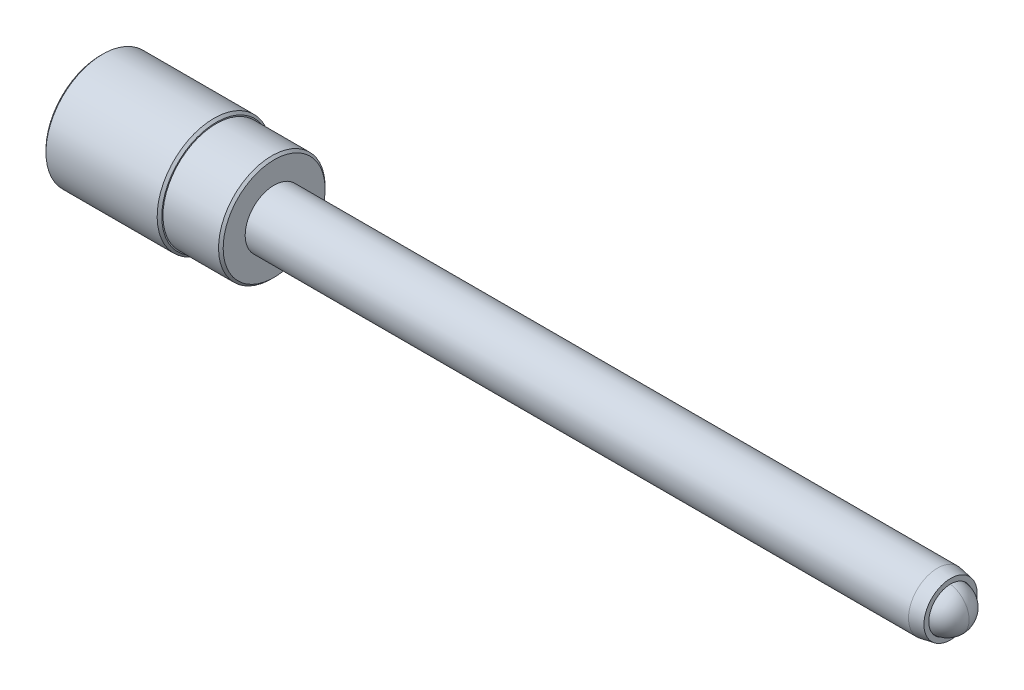
ISO-10303-21;
HEADER;
FILE_DESCRIPTION(('STEP AP214'),'2;1');
FILE_NAME('part.step','',(''),(''),'','','');
FILE_SCHEMA(('AUTOMOTIVE_DESIGN { 1 0 10303 214 1 1 1 1 }'));
ENDSEC;
DATA;
#1=APPLICATION_CONTEXT('core data for automotive mechanical design processes');
#2=APPLICATION_PROTOCOL_DEFINITION('international standard','automotive_design',2000,#1);
#3=PRODUCT_CONTEXT('',#1,'mechanical');
#4=PRODUCT('Part','Part','',(#3));
#5=PRODUCT_RELATED_PRODUCT_CATEGORY('part','',(#4));
#6=PRODUCT_DEFINITION_FORMATION('','',#4);
#7=PRODUCT_DEFINITION_CONTEXT('part definition',#1,'design');
#8=PRODUCT_DEFINITION('design','',#6,#7);
#9=PRODUCT_DEFINITION_SHAPE('','',#8);
#10=(LENGTH_UNIT() NAMED_UNIT(*) SI_UNIT(.MILLI.,.METRE.));
#11=(NAMED_UNIT(*) PLANE_ANGLE_UNIT() SI_UNIT($,.RADIAN.));
#12=(NAMED_UNIT(*) SI_UNIT($,.STERADIAN.) SOLID_ANGLE_UNIT());
#13=UNCERTAINTY_MEASURE_WITH_UNIT(LENGTH_MEASURE(1.E-05),#10,'distance_accuracy_value','');
#14=(GEOMETRIC_REPRESENTATION_CONTEXT(3) GLOBAL_UNCERTAINTY_ASSIGNED_CONTEXT((#13)) GLOBAL_UNIT_ASSIGNED_CONTEXT((#10,
#11,#12)) REPRESENTATION_CONTEXT('',''));
#15=CARTESIAN_POINT('',(0.,0.,0.));
#16=DIRECTION('',(0.,0.,1.));
#17=DIRECTION('',(1.,0.,0.));
#18=AXIS2_PLACEMENT_3D('',#15,#16,#17);
#19=CARTESIAN_POINT('',(-46.646795063286,1.45707902118473,-6.1692099702189));
#20=DIRECTION('',(-0.00174282414838957,-2.55916137059528E-06,0.999998481277566));
#21=DIRECTION('',(-0.00293678959253368,0.999995687620872,-2.55916137277076E-06));
#22=AXIS2_PLACEMENT_3D('',#19,#20,#21);
#23=SPHERICAL_SURFACE('',#22,1.190625);
#24=CARTESIAN_POINT('',(-46.6488701132877,1.45707597418323,-4.9785867784478));
#25=VERTEX_POINT('',#24);
#26=VERTEX_LOOP('',#25);
#27=FACE_BOUND('',#26,.T.);
#28=ADVANCED_FACE('P0_F13',(#27),#23,.T.);
#29=CLOSED_SHELL('',(#28));
#30=MANIFOLD_SOLID_BREP('P0_B1',#29);
#31=CARTESIAN_POINT('',(-47.837420063286,1.58320286749358,-2.10278836630096));
#32=DIRECTION('',(-1.,0.,0.));
#33=DIRECTION('',(0.,0.0426559823998968,0.999089819368359));
#34=AXIS2_PLACEMENT_3D('',#31,#32,#33);
#35=PLANE('',#34);
#36=CARTESIAN_POINT('',(-47.837420063286,1.58320286749358,-2.10278836630096));
#37=DIRECTION('',(-1.,0.,0.));
#38=DIRECTION('',(0.,0.0426559823998968,0.999089819368359));
#39=AXIS2_PLACEMENT_3D('',#36,#37,#38);
#40=CIRCLE('',#39,5.96899999999999);
#41=CARTESIAN_POINT('',(-47.837420063286,1.83781642643856,3.86077876550877));
#42=VERTEX_POINT('',#41);
#43=EDGE_CURVE('P1_E30',#42,#42,#40,.T.);
#44=ORIENTED_EDGE('',*,*,#43,.T.);
#45=EDGE_LOOP('',(#44));
#46=FACE_BOUND('',#45,.T.);
#47=CARTESIAN_POINT('',(-47.837420063286,1.4098489550204,-6.16308939221397));
#48=DIRECTION('',(-1.,0.,0.));
#49=DIRECTION('',(0.,0.0426559823998968,0.999089819368359));
#50=AXIS2_PLACEMENT_3D('',#47,#48,#49);
#51=CIRCLE('',#50,1.143);
#52=CARTESIAN_POINT('',(-47.837420063286,1.45860474290348,-5.02112972867593));
#53=VERTEX_POINT('',#52);
#54=EDGE_CURVE('P1_E57',#53,#53,#51,.T.);
#55=ORIENTED_EDGE('',*,*,#54,.F.);
#56=EDGE_LOOP('',(#55));
#57=FACE_BOUND('',#56,.T.);
#58=ADVANCED_FACE('P1_F15',(#46,#57),#35,.T.);
#59=CARTESIAN_POINT('',(-28.787420063286,1.58320286749358,-2.10278836630096));
#60=DIRECTION('',(1.,0.,0.));
#61=DIRECTION('',(0.,-0.0426559823998968,-0.999089819368359));
#62=AXIS2_PLACEMENT_3D('',#59,#60,#61);
#63=CYLINDRICAL_SURFACE('',#62,6.223);
#64=CARTESIAN_POINT('',(-47.583420063286,1.58320286749358,-2.10278836630096));
#65=DIRECTION('',(-1.,0.,0.));
#66=DIRECTION('',(0.,0.0426559823998968,0.999089819368359));
#67=AXIS2_PLACEMENT_3D('',#64,#65,#66);
#68=CIRCLE('',#67,6.223);
#69=CARTESIAN_POINT('',(-47.583420063286,1.84865104596814,4.11454757962834));
#70=VERTEX_POINT('',#69);
#71=EDGE_CURVE('P1_E35',#70,#70,#68,.F.);
#72=ORIENTED_EDGE('',*,*,#71,.T.);
#73=EDGE_LOOP('',(#72));
#74=FACE_BOUND('',#73,.T.);
#75=CARTESIAN_POINT('',(-35.391420063286,1.58320286749358,-2.10278836630096));
#76=DIRECTION('',(1.,0.,0.));
#77=DIRECTION('',(0.,-0.0426559823998968,-0.999089819368359));
#78=AXIS2_PLACEMENT_3D('',#75,#76,#77);
#79=CIRCLE('',#78,6.223);
#80=CARTESIAN_POINT('',(-35.391420063286,1.31775468901902,-8.32012431223025));
#81=VERTEX_POINT('',#80);
#82=EDGE_CURVE('P1_E38',#81,#81,#79,.F.);
#83=ORIENTED_EDGE('',*,*,#82,.T.);
#84=EDGE_LOOP('',(#83));
#85=FACE_BOUND('',#84,.T.);
#86=ADVANCED_FACE('P1_F73',(#74,#85),#63,.T.);
#87=CARTESIAN_POINT('',(-35.137420063286,1.31775468901902,-8.32012431223025));
#88=DIRECTION('',(1.,0.,0.));
#89=DIRECTION('',(0.,-0.0426559823998968,-0.999089819368359));
#90=AXIS2_PLACEMENT_3D('',#87,#88,#89);
#91=PLANE('',#90);
#92=CARTESIAN_POINT('',(-35.137420063286,1.58320286749358,-2.10278836630096));
#93=DIRECTION('',(1.,0.,0.));
#94=DIRECTION('',(0.,-0.0426559823998968,-0.999089819368359));
#95=AXIS2_PLACEMENT_3D('',#92,#93,#94);
#96=CIRCLE('',#95,5.969);
#97=CARTESIAN_POINT('',(-35.137420063286,1.32858930854859,-8.06635549811069));
#98=VERTEX_POINT('',#97);
#99=EDGE_CURVE('P1_E10',#98,#98,#96,.T.);
#100=ORIENTED_EDGE('',*,*,#99,.T.);
#101=EDGE_LOOP('',(#100));
#102=FACE_BOUND('',#101,.T.);
#103=CARTESIAN_POINT('',(-35.137420063286,1.58320286749358,-2.10278836630096));
#104=DIRECTION('',(1.,0.,0.));
#105=DIRECTION('',(0.,-0.0426559823998968,-0.999089819368359));
#106=AXIS2_PLACEMENT_3D('',#103,#104,#105);
#107=CIRCLE('',#106,5.842);
#108=CARTESIAN_POINT('',(-35.137420063286,1.33400661831338,-7.93947109105091));
#109=VERTEX_POINT('',#108);
#110=EDGE_CURVE('P1_E41',#109,#109,#107,.T.);
#111=ORIENTED_EDGE('',*,*,#110,.F.);
#112=EDGE_LOOP('',(#111));
#113=FACE_BOUND('',#112,.T.);
#114=ADVANCED_FACE('P1_F80',(#102,#113),#91,.T.);
#115=CARTESIAN_POINT('',(-28.787420063286,1.58320286749358,-2.10278836630096));
#116=DIRECTION('',(1.,0.,0.));
#117=DIRECTION('',(0.,-0.0426559823998968,-0.999089819368359));
#118=AXIS2_PLACEMENT_3D('',#115,#116,#117);
#119=CYLINDRICAL_SURFACE('',#118,5.842);
#120=CARTESIAN_POINT('',(-29.041420063286,1.58320286749358,-2.10278836630096));
#121=DIRECTION('',(1.,0.,0.));
#122=DIRECTION('',(0.,-0.0426559823998968,-0.999089819368359));
#123=AXIS2_PLACEMENT_3D('',#120,#121,#122);
#124=CIRCLE('',#123,5.842);
#125=CARTESIAN_POINT('',(-29.041420063286,1.33400661831338,-7.93947109105091));
#126=VERTEX_POINT('',#125);
#127=EDGE_CURVE('P1_E22',#126,#126,#124,.F.);
#128=ORIENTED_EDGE('',*,*,#127,.T.);
#129=EDGE_LOOP('',(#128));
#130=FACE_BOUND('',#129,.T.);
#131=ORIENTED_EDGE('',*,*,#110,.T.);
#132=EDGE_LOOP('',(#131));
#133=FACE_BOUND('',#132,.T.);
#134=ADVANCED_FACE('P1_F102',(#130,#133),#119,.T.);
#135=CARTESIAN_POINT('',(-28.787420063286,1.33400661831338,-7.93947109105091));
#136=DIRECTION('',(1.,0.,0.));
#137=DIRECTION('',(0.,-0.0426559823998968,-0.999089819368359));
#138=AXIS2_PLACEMENT_3D('',#135,#136,#137);
#139=PLANE('',#138);
#140=CARTESIAN_POINT('',(-28.787420063286,1.58320286749358,-2.10278836630096));
#141=DIRECTION('',(1.,0.,0.));
#142=DIRECTION('',(0.,-0.0426559823998968,-0.999089819368359));
#143=AXIS2_PLACEMENT_3D('',#140,#141,#142);
#144=CIRCLE('',#143,5.588);
#145=CARTESIAN_POINT('',(-28.787420063286,1.34484123784295,-7.68570227693135));
#146=VERTEX_POINT('',#145);
#147=EDGE_CURVE('P1_E26',#146,#146,#144,.T.);
#148=ORIENTED_EDGE('',*,*,#147,.T.);
#149=EDGE_LOOP('',(#148));
#150=FACE_BOUND('',#149,.T.);
#151=CARTESIAN_POINT('',(-28.787420063286,1.58320286749358,-2.10278836630096));
#152=DIRECTION('',(1.,0.,0.));
#153=DIRECTION('',(0.,-0.0426559823998968,-0.999089819368359));
#154=AXIS2_PLACEMENT_3D('',#151,#152,#153);
#155=CIRCLE('',#154,3.1496);
#156=CARTESIAN_POINT('',(-28.787420063286,1.44885358532686,-5.24952166138354));
#157=VERTEX_POINT('',#156);
#158=EDGE_CURVE('P1_E51',#157,#157,#155,.T.);
#159=ORIENTED_EDGE('',*,*,#158,.F.);
#160=EDGE_LOOP('',(#159));
#161=FACE_BOUND('',#160,.T.);
#162=ADVANCED_FACE('P1_F98',(#150,#161),#139,.T.);
#163=CARTESIAN_POINT('',(-34.883420063286,1.58320286749358,-2.10278836630096));
#164=DIRECTION('',(1.,0.,0.));
#165=DIRECTION('',(0.,-0.0426559823998968,-0.999089819368359));
#166=AXIS2_PLACEMENT_3D('',#163,#164,#165);
#167=PLANE('',#166);
#168=CARTESIAN_POINT('',(-34.883420063286,1.58320286749358,-2.10278836630096));
#169=DIRECTION('',(1.,0.,0.));
#170=DIRECTION('',(0.,-0.0426559823998968,-0.999089819368359));
#171=AXIS2_PLACEMENT_3D('',#168,#169,#170);
#172=CIRCLE('',#171,3.1496);
#173=CARTESIAN_POINT('',(-34.883420063286,1.44885358532686,-5.24952166138354));
#174=VERTEX_POINT('',#173);
#175=EDGE_CURVE('P1_E46',#174,#174,#172,.T.);
#176=ORIENTED_EDGE('',*,*,#175,.T.);
#177=EDGE_LOOP('',(#176));
#178=FACE_BOUND('',#177,.T.);
#179=CARTESIAN_POINT('',(-34.883420063286,1.58320286749358,-2.10278836630096));
#180=DIRECTION('',(1.,0.,0.));
#181=DIRECTION('',(0.,-0.0426559823998968,-0.999089819368359));
#182=AXIS2_PLACEMENT_3D('',#179,#180,#181);
#183=CIRCLE('',#182,2.9718);
#184=CARTESIAN_POINT('',(-34.883420063286,1.45643781899756,-5.07188349149984));
#185=VERTEX_POINT('',#184);
#186=EDGE_CURVE('P1_E42',#185,#185,#183,.F.);
#187=ORIENTED_EDGE('',*,*,#186,.T.);
#188=EDGE_LOOP('',(#187));
#189=FACE_BOUND('',#188,.T.);
#190=ADVANCED_FACE('P1_F101',(#178,#189),#167,.T.);
#191=CARTESIAN_POINT('',(-34.883420063286,1.58320286749358,-2.10278836630096));
#192=DIRECTION('',(1.,0.,0.));
#193=DIRECTION('',(0.,-0.0426559823998968,-0.999089819368359));
#194=AXIS2_PLACEMENT_3D('',#191,#192,#193);
#195=CYLINDRICAL_SURFACE('',#194,3.1496);
#196=ORIENTED_EDGE('',*,*,#175,.F.);
#197=EDGE_LOOP('',(#196));
#198=FACE_BOUND('',#197,.T.);
#199=ORIENTED_EDGE('',*,*,#158,.T.);
#200=EDGE_LOOP('',(#199));
#201=FACE_BOUND('',#200,.T.);
#202=ADVANCED_FACE('P1_F106',(#198,#201),#195,.F.);
#203=CARTESIAN_POINT('',(-41.487420063286,1.58320286749358,-2.10278836630096));
#204=DIRECTION('',(1.,0.,0.));
#205=DIRECTION('',(0.,-0.0426559823998968,-0.999089819368359));
#206=AXIS2_PLACEMENT_3D('',#203,#204,#205);
#207=PLANE('',#206);
#208=CARTESIAN_POINT('',(-41.487420063286,1.58320286749358,-2.10278836630096));
#209=DIRECTION('',(1.,0.,0.));
#210=DIRECTION('',(0.,-0.0426559823998968,-0.999089819368359));
#211=AXIS2_PLACEMENT_3D('',#208,#209,#210);
#212=CIRCLE('',#211,2.9718);
#213=CARTESIAN_POINT('',(-41.487420063286,1.45643781899756,-5.07188349149984));
#214=VERTEX_POINT('',#213);
#215=EDGE_CURVE('P1_E45',#214,#214,#212,.T.);
#216=ORIENTED_EDGE('',*,*,#215,.T.);
#217=EDGE_LOOP('',(#216));
#218=FACE_BOUND('',#217,.T.);
#219=ADVANCED_FACE('P1_F108',(#218),#207,.T.);
#220=CARTESIAN_POINT('',(-41.487420063286,1.58320286749358,-2.10278836630096));
#221=DIRECTION('',(1.,0.,0.));
#222=DIRECTION('',(0.,-0.0426559823998968,-0.999089819368359));
#223=AXIS2_PLACEMENT_3D('',#220,#221,#222);
#224=CYLINDRICAL_SURFACE('',#223,2.9718);
#225=ORIENTED_EDGE('',*,*,#215,.F.);
#226=EDGE_LOOP('',(#225));
#227=FACE_BOUND('',#226,.T.);
#228=ORIENTED_EDGE('',*,*,#186,.F.);
#229=EDGE_LOOP('',(#228));
#230=FACE_BOUND('',#229,.T.);
#231=ADVANCED_FACE('P1_F68',(#227,#230),#224,.F.);
#232=CARTESIAN_POINT('',(-45.551420063286,1.4098489550204,-6.16308939221397));
#233=DIRECTION('',(-1.,0.,0.));
#234=DIRECTION('',(0.,0.0426559823998968,0.999089819368359));
#235=AXIS2_PLACEMENT_3D('',#232,#233,#234);
#236=CYLINDRICAL_SURFACE('',#235,1.143);
#237=CARTESIAN_POINT('',(-45.551420063286,1.4098489550204,-6.16308939221397));
#238=DIRECTION('',(-1.,0.,0.));
#239=DIRECTION('',(0.,0.0426559823998968,0.999089819368359));
#240=AXIS2_PLACEMENT_3D('',#237,#238,#239);
#241=CIRCLE('',#240,1.143);
#242=CARTESIAN_POINT('',(-45.551420063286,1.45860474290348,-5.02112972867593));
#243=VERTEX_POINT('',#242);
#244=EDGE_CURVE('P1_E54',#243,#243,#241,.T.);
#245=ORIENTED_EDGE('',*,*,#244,.F.);
#246=EDGE_LOOP('',(#245));
#247=FACE_BOUND('',#246,.T.);
#248=ORIENTED_EDGE('',*,*,#54,.T.);
#249=EDGE_LOOP('',(#248));
#250=FACE_BOUND('',#249,.T.);
#251=ADVANCED_FACE('P1_F65',(#247,#250),#236,.F.);
#252=CARTESIAN_POINT('',(-45.551420063286,1.4098489550204,-6.16308939221397));
#253=DIRECTION('',(-1.,0.,0.));
#254=DIRECTION('',(0.,0.0426559823998968,0.999089819368359));
#255=AXIS2_PLACEMENT_3D('',#252,#253,#254);
#256=PLANE('',#255);
#257=ORIENTED_EDGE('',*,*,#244,.T.);
#258=EDGE_LOOP('',(#257));
#259=FACE_BOUND('',#258,.T.);
#260=ADVANCED_FACE('P1_F63',(#259),#256,.T.);
#261=CARTESIAN_POINT('',(-47.583420063286,1.58320286749358,-2.10278836630096));
#262=DIRECTION('',(1.,0.,0.));
#263=DIRECTION('',(0.,-0.0426559823998968,-0.999089819368359));
#264=AXIS2_PLACEMENT_3D('',#261,#262,#263);
#265=CONICAL_SURFACE('',#264,6.223,0.78539816339745);
#266=ORIENTED_EDGE('',*,*,#43,.F.);
#267=EDGE_LOOP('',(#266));
#268=FACE_BOUND('',#267,.T.);
#269=ORIENTED_EDGE('',*,*,#71,.F.);
#270=EDGE_LOOP('',(#269));
#271=FACE_BOUND('',#270,.T.);
#272=ADVANCED_FACE('P1_F85',(#268,#271),#265,.T.);
#273=CARTESIAN_POINT('',(-28.787420063286,1.58320286749358,-2.10278836630096));
#274=DIRECTION('',(-1.,0.,0.));
#275=DIRECTION('',(0.,0.0426559823998968,0.999089819368359));
#276=AXIS2_PLACEMENT_3D('',#273,#274,#275);
#277=CONICAL_SURFACE('',#276,5.588,0.785398163397443);
#278=ORIENTED_EDGE('',*,*,#127,.F.);
#279=EDGE_LOOP('',(#278));
#280=FACE_BOUND('',#279,.T.);
#281=ORIENTED_EDGE('',*,*,#147,.F.);
#282=EDGE_LOOP('',(#281));
#283=FACE_BOUND('',#282,.T.);
#284=ADVANCED_FACE('P1_F87',(#280,#283),#277,.T.);
#285=CARTESIAN_POINT('',(-35.137420063286,1.58320286749358,-2.10278836630096));
#286=DIRECTION('',(-1.,0.,0.));
#287=DIRECTION('',(0.,0.0426559823998968,0.999089819368359));
#288=AXIS2_PLACEMENT_3D('',#285,#286,#287);
#289=CONICAL_SURFACE('',#288,5.969,0.785398163397447);
#290=ORIENTED_EDGE('',*,*,#82,.F.);
#291=EDGE_LOOP('',(#290));
#292=FACE_BOUND('',#291,.T.);
#293=ORIENTED_EDGE('',*,*,#99,.F.);
#294=EDGE_LOOP('',(#293));
#295=FACE_BOUND('',#294,.T.);
#296=ADVANCED_FACE('P1_F17',(#292,#295),#289,.T.);
#297=CLOSED_SHELL('',(#58,#86,#114,#134,#162,#190,#202,#219,#231,#251,#260,#272,#284,#296));
#298=MANIFOLD_SOLID_BREP('P1_B1',#297);
#299=CARTESIAN_POINT('',(45.031329936714,1.58320286749359,-2.10278836630096));
#300=DIRECTION('',(-1.,0.,0.));
#301=DIRECTION('',(0.,1.,0.));
#302=AXIS2_PLACEMENT_3D('',#299,#300,#301);
#303=SPHERICAL_SURFACE('',#302,2.38125);
#304=CARTESIAN_POINT('',(45.031329936714,1.58320286749359,-2.10278836630096));
#305=DIRECTION('',(0.,0.,1.));
#306=DIRECTION('',(0.,1.,0.));
#307=AXIS2_PLACEMENT_3D('',#304,#305,#306);
#308=CIRCLE('',#307,2.38125);
#309=CARTESIAN_POINT('',(45.031329936714,3.96445286749359,-2.10278836630096));
#310=VERTEX_POINT('',#309);
#311=CARTESIAN_POINT('',(45.031329936714,-0.798047132506413,-2.10278836630096));
#312=VERTEX_POINT('',#311);
#313=EDGE_CURVE('P2_E33',#310,#312,#308,.T.);
#314=ORIENTED_EDGE('',*,*,#313,.T.);
#315=CARTESIAN_POINT('',(45.031329936714,1.58320286749359,-2.10278836630096));
#316=DIRECTION('',(-1.,0.,0.));
#317=DIRECTION('',(0.,0.,1.));
#318=AXIS2_PLACEMENT_3D('',#315,#316,#317);
#319=CIRCLE('',#318,2.38125);
#320=EDGE_CURVE('P2_E10',#312,#310,#319,.T.);
#321=ORIENTED_EDGE('',*,*,#320,.T.);
#322=EDGE_LOOP('',(#314,#321));
#323=FACE_BOUND('',#322,.T.);
#324=ADVANCED_FACE('P2_F16',(#323),#303,.T.);
#325=ORIENTED_EDGE('',*,*,#313,.F.);
#326=CARTESIAN_POINT('',(45.031329936714,1.58320286749359,-2.10278836630096));
#327=DIRECTION('',(-1.,0.,0.));
#328=DIRECTION('',(0.,0.,1.));
#329=AXIS2_PLACEMENT_3D('',#326,#327,#328);
#330=CIRCLE('',#329,2.38125);
#331=EDGE_CURVE('P2_E23',#310,#312,#330,.T.);
#332=ORIENTED_EDGE('',*,*,#331,.T.);
#333=EDGE_LOOP('',(#325,#332));
#334=FACE_BOUND('',#333,.T.);
#335=ADVANCED_FACE('P2_F40',(#334),#303,.T.);
#336=ORIENTED_EDGE('',*,*,#320,.F.);
#337=EDGE_CURVE('P2_E36',#312,#310,#308,.T.);
#338=ORIENTED_EDGE('',*,*,#337,.T.);
#339=EDGE_LOOP('',(#336,#338));
#340=FACE_BOUND('',#339,.T.);
#341=ADVANCED_FACE('P2_F38',(#340),#303,.T.);
#342=ORIENTED_EDGE('',*,*,#331,.F.);
#343=ORIENTED_EDGE('',*,*,#337,.F.);
#344=EDGE_LOOP('',(#342,#343));
#345=FACE_BOUND('',#344,.T.);
#346=ADVANCED_FACE('P2_F18',(#345),#303,.T.);
#347=CLOSED_SHELL('',(#324,#335,#341,#346));
#348=MANIFOLD_SOLID_BREP('P2_B1',#347);
#349=CARTESIAN_POINT('',(41.6637338913131,1.58320286749359,-2.10278836630096));
#350=DIRECTION('',(1.,0.,0.));
#351=DIRECTION('',(0.,1.,0.));
#352=AXIS2_PLACEMENT_3D('',#349,#350,#351);
#353=CONICAL_SURFACE('',#352,0.,0.78539816339745);
#354=CARTESIAN_POINT('',(44.051333891313,1.58320286749359,-2.10278836630096));
#355=DIRECTION('',(1.,0.,0.));
#356=DIRECTION('',(0.,1.,0.));
#357=AXIS2_PLACEMENT_3D('',#354,#355,#356);
#358=CIRCLE('',#357,2.3876);
#359=CARTESIAN_POINT('',(44.051333891313,3.97080286749359,-2.10278836630096));
#360=VERTEX_POINT('',#359);
#361=EDGE_CURVE('P3_E11',#360,#360,#358,.T.);
#362=ORIENTED_EDGE('',*,*,#361,.T.);
#363=EDGE_LOOP('',(#362));
#364=FACE_BOUND('',#363,.T.);
#365=CARTESIAN_POINT('',(41.6637338913131,1.58320286749359,-2.10278836630096));
#366=VERTEX_POINT('',#365);
#367=VERTEX_LOOP('',#366);
#368=FACE_BOUND('',#367,.T.);
#369=ADVANCED_FACE('P3_F17',(#364,#368),#353,.F.);
#370=CARTESIAN_POINT('',(41.6637338913131,1.58320286749359,-2.10278836630096));
#371=DIRECTION('',(1.,0.,0.));
#372=DIRECTION('',(0.,1.,0.));
#373=AXIS2_PLACEMENT_3D('',#370,#371,#372);
#374=CYLINDRICAL_SURFACE('',#373,2.3876);
#375=CARTESIAN_POINT('',(45.380579936714,1.58320286749359,-2.10278836630096));
#376=DIRECTION('',(1.,0.,0.));
#377=DIRECTION('',(0.,1.,0.));
#378=AXIS2_PLACEMENT_3D('',#375,#376,#377);
#379=CIRCLE('',#378,2.3876);
#380=CARTESIAN_POINT('',(45.380579936714,3.97080286749359,-2.10278836630096));
#381=VERTEX_POINT('',#380);
#382=EDGE_CURVE('P3_E23',#381,#381,#379,.T.);
#383=ORIENTED_EDGE('',*,*,#382,.T.);
#384=EDGE_LOOP('',(#383));
#385=FACE_BOUND('',#384,.T.);
#386=ORIENTED_EDGE('',*,*,#361,.F.);
#387=EDGE_LOOP('',(#386));
#388=FACE_BOUND('',#387,.T.);
#389=ADVANCED_FACE('P3_F27',(#385,#388),#374,.F.);
#390=CARTESIAN_POINT('',(45.380579936714,4.50420286749358,-2.10278836630096));
#391=DIRECTION('',(1.,0.,0.));
#392=DIRECTION('',(0.,1.,0.));
#393=AXIS2_PLACEMENT_3D('',#390,#391,#392);
#394=PLANE('',#393);
#395=CARTESIAN_POINT('',(45.380579936714,1.58320286749359,-2.10278836630096));
#396=DIRECTION('',(1.,0.,0.));
#397=DIRECTION('',(0.,1.,0.));
#398=AXIS2_PLACEMENT_3D('',#395,#396,#397);
#399=CIRCLE('',#398,2.92099999999999);
#400=CARTESIAN_POINT('',(45.380579936714,4.50420286749358,-2.10278836630096));
#401=VERTEX_POINT('',#400);
#402=EDGE_CURVE('P3_E72',#401,#401,#399,.T.);
#403=ORIENTED_EDGE('',*,*,#402,.T.);
#404=EDGE_LOOP('',(#403));
#405=FACE_BOUND('',#404,.T.);
#406=ORIENTED_EDGE('',*,*,#382,.F.);
#407=EDGE_LOOP('',(#406));
#408=FACE_BOUND('',#407,.T.);
#409=ADVANCED_FACE('P3_F33',(#405,#408),#394,.T.);
#410=CARTESIAN_POINT('',(45.380579936714,1.58320286749359,-2.10278836630096));
#411=DIRECTION('',(-1.,0.,0.));
#412=DIRECTION('',(0.,-1.,0.));
#413=AXIS2_PLACEMENT_3D('',#410,#411,#412);
#414=CONICAL_SURFACE('',#413,2.92099999999999,0.174532925199434);
#415=CARTESIAN_POINT('',(43.9400743545311,1.58320286749359,-2.10278836630096));
#416=DIRECTION('',(1.,0.,0.));
#417=DIRECTION('',(0.,1.,0.));
#418=AXIS2_PLACEMENT_3D('',#415,#416,#417);
#419=CIRCLE('',#418,3.17499999999999);
#420=CARTESIAN_POINT('',(43.9400743545311,4.75820286749358,-2.10278836630096));
#421=VERTEX_POINT('',#420);
#422=EDGE_CURVE('P3_E67',#421,#421,#419,.T.);
#423=ORIENTED_EDGE('',*,*,#422,.T.);
#424=EDGE_LOOP('',(#423));
#425=FACE_BOUND('',#424,.T.);
#426=ORIENTED_EDGE('',*,*,#402,.F.);
#427=EDGE_LOOP('',(#426));
#428=FACE_BOUND('',#427,.T.);
#429=ADVANCED_FACE('P3_F40',(#425,#428),#414,.T.);
#430=CARTESIAN_POINT('',(41.6637338913131,1.58320286749359,-2.10278836630096));
#431=DIRECTION('',(1.,0.,0.));
#432=DIRECTION('',(0.,1.,0.));
#433=AXIS2_PLACEMENT_3D('',#430,#431,#432);
#434=CYLINDRICAL_SURFACE('',#433,3.175);
#435=CARTESIAN_POINT('',(-41.233420063286,1.58320286749358,-2.10278836630096));
#436=DIRECTION('',(1.,0.,0.));
#437=DIRECTION('',(0.,1.,0.));
#438=AXIS2_PLACEMENT_3D('',#435,#436,#437);
#439=CIRCLE('',#438,3.175);
#440=CARTESIAN_POINT('',(-41.233420063286,4.75820286749358,-2.10278836630096));
#441=VERTEX_POINT('',#440);
#442=EDGE_CURVE('P3_E64',#441,#441,#439,.T.);
#443=ORIENTED_EDGE('',*,*,#442,.T.);
#444=EDGE_LOOP('',(#443));
#445=FACE_BOUND('',#444,.T.);
#446=ORIENTED_EDGE('',*,*,#422,.F.);
#447=EDGE_LOOP('',(#446));
#448=FACE_BOUND('',#447,.T.);
#449=ADVANCED_FACE('P3_F47',(#445,#448),#434,.T.);
#450=CARTESIAN_POINT('',(-41.233420063286,1.58320286749358,-2.10278836630096));
#451=DIRECTION('',(1.,0.,0.));
#452=DIRECTION('',(0.,1.,0.));
#453=AXIS2_PLACEMENT_3D('',#450,#451,#452);
#454=CONICAL_SURFACE('',#453,3.175,0.78539816339744);
#455=CARTESIAN_POINT('',(-41.487420063286,1.58320286749358,-2.10278836630096));
#456=DIRECTION('',(1.,0.,0.));
#457=DIRECTION('',(0.,1.,0.));
#458=AXIS2_PLACEMENT_3D('',#455,#456,#457);
#459=CIRCLE('',#458,2.921);
#460=CARTESIAN_POINT('',(-41.487420063286,4.50420286749358,-2.10278836630096));
#461=VERTEX_POINT('',#460);
#462=EDGE_CURVE('P3_E63',#461,#461,#459,.T.);
#463=ORIENTED_EDGE('',*,*,#462,.T.);
#464=EDGE_LOOP('',(#463));
#465=FACE_BOUND('',#464,.T.);
#466=ORIENTED_EDGE('',*,*,#442,.F.);
#467=EDGE_LOOP('',(#466));
#468=FACE_BOUND('',#467,.T.);
#469=ADVANCED_FACE('P3_F51',(#465,#468),#454,.T.);
#470=CARTESIAN_POINT('',(-41.487420063286,1.58320286749358,-2.10278836630096));
#471=DIRECTION('',(-1.,0.,0.));
#472=DIRECTION('',(0.,-1.,0.));
#473=AXIS2_PLACEMENT_3D('',#470,#471,#472);
#474=PLANE('',#473);
#475=ORIENTED_EDGE('',*,*,#462,.F.);
#476=EDGE_LOOP('',(#475));
#477=FACE_BOUND('',#476,.T.);
#478=ADVANCED_FACE('P3_F55',(#477),#474,.T.);
#479=CLOSED_SHELL('',(#369,#389,#409,#429,#449,#469,#478));
#480=MANIFOLD_SOLID_BREP('P3_B1',#479);
#481=ADVANCED_BREP_SHAPE_REPRESENTATION('',(#18,#30,#298,#348,#480),#14);
#482=SHAPE_DEFINITION_REPRESENTATION(#9,#481);
ENDSEC;
END-ISO-10303-21;
